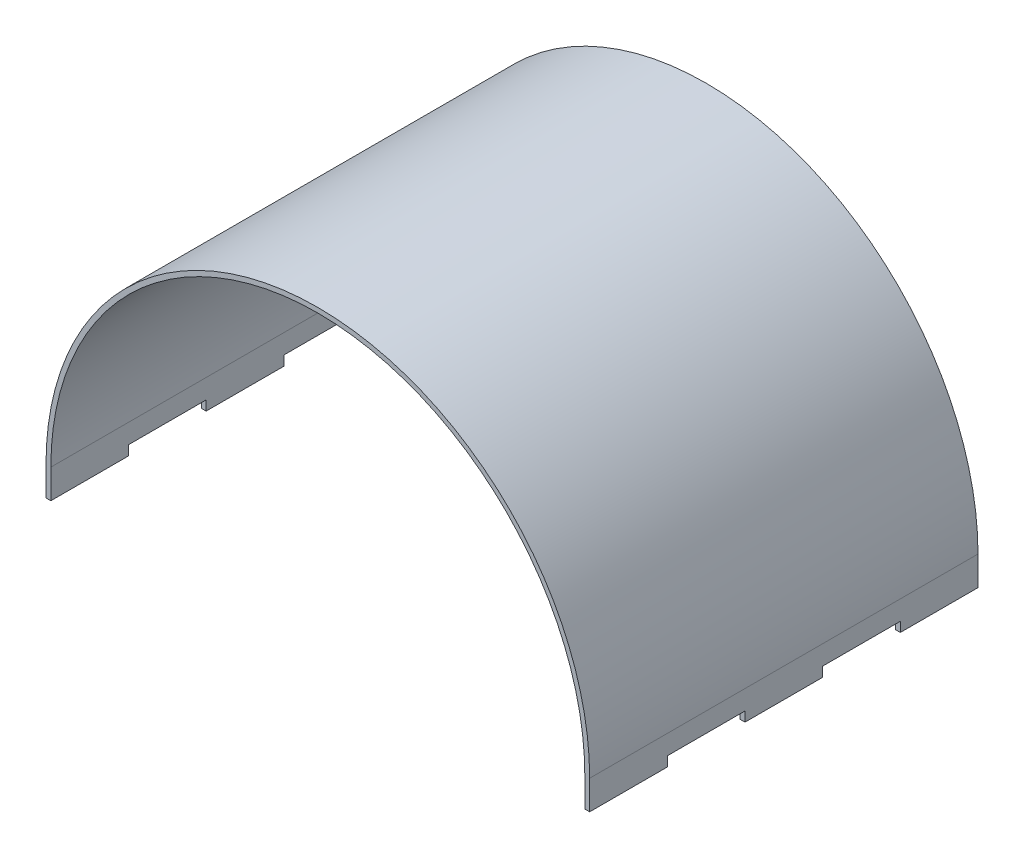
ISO-10303-21;
HEADER;
FILE_DESCRIPTION(('STEP AP214'),'2;1');
FILE_NAME('part.step','',(''),(''),'','','');
FILE_SCHEMA(('AUTOMOTIVE_DESIGN { 1 0 10303 214 1 1 1 1 }'));
ENDSEC;
DATA;
#1=APPLICATION_CONTEXT('core data for automotive mechanical design processes');
#2=APPLICATION_PROTOCOL_DEFINITION('international standard','automotive_design',2000,#1);
#3=PRODUCT_CONTEXT('',#1,'mechanical');
#4=PRODUCT('Part','Part','',(#3));
#5=PRODUCT_RELATED_PRODUCT_CATEGORY('part','',(#4));
#6=PRODUCT_DEFINITION_FORMATION('','',#4);
#7=PRODUCT_DEFINITION_CONTEXT('part definition',#1,'design');
#8=PRODUCT_DEFINITION('design','',#6,#7);
#9=PRODUCT_DEFINITION_SHAPE('','',#8);
#10=(LENGTH_UNIT() NAMED_UNIT(*) SI_UNIT(.MILLI.,.METRE.));
#11=(NAMED_UNIT(*) PLANE_ANGLE_UNIT() SI_UNIT($,.RADIAN.));
#12=(NAMED_UNIT(*) SI_UNIT($,.STERADIAN.) SOLID_ANGLE_UNIT());
#13=UNCERTAINTY_MEASURE_WITH_UNIT(LENGTH_MEASURE(1.E-05),#10,'distance_accuracy_value','');
#14=(GEOMETRIC_REPRESENTATION_CONTEXT(3) GLOBAL_UNCERTAINTY_ASSIGNED_CONTEXT((#13)) GLOBAL_UNIT_ASSIGNED_CONTEXT((#10,
#11,#12)) REPRESENTATION_CONTEXT('',''));
#15=CARTESIAN_POINT('',(0.,0.,0.));
#16=DIRECTION('',(0.,0.,1.));
#17=DIRECTION('',(1.,0.,0.));
#18=AXIS2_PLACEMENT_3D('',#15,#16,#17);
#19=CARTESIAN_POINT('',(0.,0.,254.));
#20=DIRECTION('',(0.,1.,0.));
#21=DIRECTION('',(0.,0.,1.));
#22=AXIS2_PLACEMENT_3D('',#19,#20,#21);
#23=PLANE('',#22);
#24=DIRECTION('',(1.,0.,0.));
#25=VECTOR('',#24,1.);
#26=CARTESIAN_POINT('',(0.,0.,203.2));
#27=LINE('',#26,#25);
#28=CARTESIAN_POINT('',(0.,0.,203.2));
#29=VERTEX_POINT('',#28);
#30=CARTESIAN_POINT('',(3.175,0.,203.2));
#31=VERTEX_POINT('',#30);
#32=EDGE_CURVE('E235',#29,#31,#27,.T.);
#33=ORIENTED_EDGE('',*,*,#32,.T.);
#34=DIRECTION('',(0.,0.,-1.));
#35=VECTOR('',#34,1.);
#36=CARTESIAN_POINT('',(3.175,0.,254.));
#37=LINE('',#36,#35);
#38=CARTESIAN_POINT('',(3.175,0.,254.));
#39=VERTEX_POINT('',#38);
#40=EDGE_CURVE('E353',#39,#31,#37,.T.);
#41=ORIENTED_EDGE('',*,*,#40,.F.);
#42=DIRECTION('',(1.,0.,0.));
#43=VECTOR('',#42,1.);
#44=CARTESIAN_POINT('',(0.,0.,254.));
#45=LINE('',#44,#43);
#46=CARTESIAN_POINT('',(0.,0.,254.));
#47=VERTEX_POINT('',#46);
#48=EDGE_CURVE('E298',#47,#39,#45,.T.);
#49=ORIENTED_EDGE('',*,*,#48,.F.);
#50=DIRECTION('',(0.,0.,-1.));
#51=VECTOR('',#50,1.);
#52=CARTESIAN_POINT('',(0.,0.,254.));
#53=LINE('',#52,#51);
#54=EDGE_CURVE('E11',#47,#29,#53,.T.);
#55=ORIENTED_EDGE('',*,*,#54,.T.);
#56=EDGE_LOOP('',(#33,#41,#49,#55));
#57=FACE_BOUND('',#56,.T.);
#58=ADVANCED_FACE('F35',(#57),#23,.F.);
#59=CARTESIAN_POINT('',(3.175,0.,152.4));
#60=VERTEX_POINT('',#59);
#61=CARTESIAN_POINT('',(3.175,0.,101.6));
#62=VERTEX_POINT('',#61);
#63=EDGE_CURVE('E355',#60,#62,#37,.T.);
#64=ORIENTED_EDGE('',*,*,#63,.F.);
#65=DIRECTION('',(1.,0.,0.));
#66=VECTOR('',#65,1.);
#67=CARTESIAN_POINT('',(0.,0.,152.4));
#68=LINE('',#67,#66);
#69=CARTESIAN_POINT('',(0.,0.,152.4));
#70=VERTEX_POINT('',#69);
#71=EDGE_CURVE('E239',#70,#60,#68,.T.);
#72=ORIENTED_EDGE('',*,*,#71,.F.);
#73=CARTESIAN_POINT('',(0.,0.,101.6));
#74=VERTEX_POINT('',#73);
#75=EDGE_CURVE('E43',#70,#74,#53,.T.);
#76=ORIENTED_EDGE('',*,*,#75,.T.);
#77=DIRECTION('',(1.,0.,0.));
#78=VECTOR('',#77,1.);
#79=CARTESIAN_POINT('',(0.,0.,101.6));
#80=LINE('',#79,#78);
#81=EDGE_CURVE('E249',#74,#62,#80,.T.);
#82=ORIENTED_EDGE('',*,*,#81,.T.);
#83=EDGE_LOOP('',(#64,#72,#76,#82));
#84=FACE_BOUND('',#83,.T.);
#85=ADVANCED_FACE('F452',(#84),#23,.F.);
#86=CARTESIAN_POINT('',(352.425,0.,254.));
#87=DIRECTION('',(0.,1.,0.));
#88=DIRECTION('',(0.,0.,1.));
#89=AXIS2_PLACEMENT_3D('',#86,#87,#88);
#90=PLANE('',#89);
#91=CARTESIAN_POINT('',(352.425,0.,203.2));
#92=VERTEX_POINT('',#91);
#93=CARTESIAN_POINT('',(355.6,0.,203.2));
#94=VERTEX_POINT('',#93);
#95=EDGE_CURVE('E234',#92,#94,#27,.T.);
#96=ORIENTED_EDGE('',*,*,#95,.T.);
#97=DIRECTION('',(0.,0.,-1.));
#98=VECTOR('',#97,1.);
#99=CARTESIAN_POINT('',(355.6,0.,254.));
#100=LINE('',#99,#98);
#101=CARTESIAN_POINT('',(355.6,0.,254.));
#102=VERTEX_POINT('',#101);
#103=EDGE_CURVE('E338',#102,#94,#100,.T.);
#104=ORIENTED_EDGE('',*,*,#103,.F.);
#105=DIRECTION('',(1.,0.,0.));
#106=VECTOR('',#105,1.);
#107=CARTESIAN_POINT('',(352.425,0.,254.));
#108=LINE('',#107,#106);
#109=CARTESIAN_POINT('',(352.425,0.,254.));
#110=VERTEX_POINT('',#109);
#111=EDGE_CURVE('E307',#110,#102,#108,.T.);
#112=ORIENTED_EDGE('',*,*,#111,.F.);
#113=DIRECTION('',(0.,0.,-1.));
#114=VECTOR('',#113,1.);
#115=CARTESIAN_POINT('',(352.425,0.,254.));
#116=LINE('',#115,#114);
#117=EDGE_CURVE('E343',#110,#92,#116,.T.);
#118=ORIENTED_EDGE('',*,*,#117,.T.);
#119=EDGE_LOOP('',(#96,#104,#112,#118));
#120=FACE_BOUND('',#119,.T.);
#121=ADVANCED_FACE('F439',(#120),#90,.F.);
#122=CARTESIAN_POINT('',(355.6,0.,152.4));
#123=VERTEX_POINT('',#122);
#124=CARTESIAN_POINT('',(355.6,0.,101.6));
#125=VERTEX_POINT('',#124);
#126=EDGE_CURVE('E342',#123,#125,#100,.T.);
#127=ORIENTED_EDGE('',*,*,#126,.F.);
#128=CARTESIAN_POINT('',(352.425,0.,152.4));
#129=VERTEX_POINT('',#128);
#130=EDGE_CURVE('E238',#129,#123,#68,.T.);
#131=ORIENTED_EDGE('',*,*,#130,.F.);
#132=CARTESIAN_POINT('',(352.425,0.,101.6));
#133=VERTEX_POINT('',#132);
#134=EDGE_CURVE('E347',#129,#133,#116,.T.);
#135=ORIENTED_EDGE('',*,*,#134,.T.);
#136=EDGE_CURVE('E248',#133,#125,#80,.T.);
#137=ORIENTED_EDGE('',*,*,#136,.T.);
#138=EDGE_LOOP('',(#127,#131,#135,#137));
#139=FACE_BOUND('',#138,.T.);
#140=ADVANCED_FACE('F416',(#139),#90,.F.);
#141=CARTESIAN_POINT('',(0.,0.,254.));
#142=DIRECTION('',(1.,0.,0.));
#143=DIRECTION('',(0.,0.,-1.));
#144=AXIS2_PLACEMENT_3D('',#141,#142,#143);
#145=PLANE('',#144);
#146=ORIENTED_EDGE('',*,*,#75,.F.);
#147=DIRECTION('',(0.,1.,0.));
#148=VECTOR('',#147,1.);
#149=CARTESIAN_POINT('',(0.,0.,152.4));
#150=LINE('',#149,#148);
#151=CARTESIAN_POINT('',(0.,6.35,152.4));
#152=VERTEX_POINT('',#151);
#153=EDGE_CURVE('E205',#70,#152,#150,.T.);
#154=ORIENTED_EDGE('',*,*,#153,.T.);
#155=DIRECTION('',(0.,0.,-1.));
#156=VECTOR('',#155,1.);
#157=CARTESIAN_POINT('',(0.,6.35,203.2));
#158=LINE('',#157,#156);
#159=CARTESIAN_POINT('',(0.,6.35,203.2));
#160=VERTEX_POINT('',#159);
#161=EDGE_CURVE('E197',#160,#152,#158,.T.);
#162=ORIENTED_EDGE('',*,*,#161,.F.);
#163=DIRECTION('',(0.,1.,0.));
#164=VECTOR('',#163,1.);
#165=CARTESIAN_POINT('',(0.,0.,203.2));
#166=LINE('',#165,#164);
#167=EDGE_CURVE('E219',#29,#160,#166,.T.);
#168=ORIENTED_EDGE('',*,*,#167,.F.);
#169=ORIENTED_EDGE('',*,*,#54,.F.);
#170=DIRECTION('',(0.,-1.,0.));
#171=VECTOR('',#170,1.);
#172=CARTESIAN_POINT('',(0.,0.,254.));
#173=LINE('',#172,#171);
#174=CARTESIAN_POINT('',(0.,19.05,254.));
#175=VERTEX_POINT('',#174);
#176=EDGE_CURVE('E295',#175,#47,#173,.T.);
#177=ORIENTED_EDGE('',*,*,#176,.F.);
#178=DIRECTION('',(0.,0.,-1.));
#179=VECTOR('',#178,1.);
#180=CARTESIAN_POINT('',(0.,19.05,254.));
#181=LINE('',#180,#179);
#182=CARTESIAN_POINT('',(0.,19.05,0.));
#183=VERTEX_POINT('',#182);
#184=EDGE_CURVE('E313',#175,#183,#181,.T.);
#185=ORIENTED_EDGE('',*,*,#184,.T.);
#186=DIRECTION('',(0.,-1.,0.));
#187=VECTOR('',#186,1.);
#188=CARTESIAN_POINT('',(0.,0.,0.));
#189=LINE('',#188,#187);
#190=CARTESIAN_POINT('',(0.,0.,0.));
#191=VERTEX_POINT('',#190);
#192=EDGE_CURVE('E294',#183,#191,#189,.T.);
#193=ORIENTED_EDGE('',*,*,#192,.T.);
#194=CARTESIAN_POINT('',(0.,0.,50.8));
#195=VERTEX_POINT('',#194);
#196=EDGE_CURVE('E44',#195,#191,#53,.T.);
#197=ORIENTED_EDGE('',*,*,#196,.F.);
#198=DIRECTION('',(0.,1.,0.));
#199=VECTOR('',#198,1.);
#200=CARTESIAN_POINT('',(0.,0.,50.8));
#201=LINE('',#200,#199);
#202=CARTESIAN_POINT('',(0.,6.35,50.8));
#203=VERTEX_POINT('',#202);
#204=EDGE_CURVE('E265',#195,#203,#201,.T.);
#205=ORIENTED_EDGE('',*,*,#204,.T.);
#206=DIRECTION('',(0.,0.,-1.));
#207=VECTOR('',#206,1.);
#208=CARTESIAN_POINT('',(0.,6.35,101.6));
#209=LINE('',#208,#207);
#210=CARTESIAN_POINT('',(0.,6.35,101.6));
#211=VERTEX_POINT('',#210);
#212=EDGE_CURVE('E259',#211,#203,#209,.T.);
#213=ORIENTED_EDGE('',*,*,#212,.F.);
#214=DIRECTION('',(0.,1.,0.));
#215=VECTOR('',#214,1.);
#216=CARTESIAN_POINT('',(0.,0.,101.6));
#217=LINE('',#216,#215);
#218=EDGE_CURVE('E254',#74,#211,#217,.T.);
#219=ORIENTED_EDGE('',*,*,#218,.F.);
#220=EDGE_LOOP('',(#146,#154,#162,#168,#169,#177,#185,#193,#197,#205,#213,#219));
#221=FACE_BOUND('',#220,.T.);
#222=ADVANCED_FACE('F37',(#221),#145,.F.);
#223=CARTESIAN_POINT('',(3.175,0.,50.8));
#224=VERTEX_POINT('',#223);
#225=CARTESIAN_POINT('',(3.175,0.,0.));
#226=VERTEX_POINT('',#225);
#227=EDGE_CURVE('E352',#224,#226,#37,.T.);
#228=ORIENTED_EDGE('',*,*,#227,.F.);
#229=DIRECTION('',(1.,0.,0.));
#230=VECTOR('',#229,1.);
#231=CARTESIAN_POINT('',(0.,0.,50.8));
#232=LINE('',#231,#230);
#233=EDGE_CURVE('E246',#195,#224,#232,.T.);
#234=ORIENTED_EDGE('',*,*,#233,.F.);
#235=ORIENTED_EDGE('',*,*,#196,.T.);
#236=DIRECTION('',(1.,0.,0.));
#237=VECTOR('',#236,1.);
#238=CARTESIAN_POINT('',(0.,0.,0.));
#239=LINE('',#238,#237);
#240=EDGE_CURVE('E316',#191,#226,#239,.T.);
#241=ORIENTED_EDGE('',*,*,#240,.T.);
#242=EDGE_LOOP('',(#228,#234,#235,#241));
#243=FACE_BOUND('',#242,.T.);
#244=ADVANCED_FACE('F369',(#243),#23,.F.);
#245=CARTESIAN_POINT('',(3.175,0.,254.));
#246=DIRECTION('',(-1.,0.,0.));
#247=DIRECTION('',(0.,0.,1.));
#248=AXIS2_PLACEMENT_3D('',#245,#246,#247);
#249=PLANE('',#248);
#250=DIRECTION('',(0.,0.,1.));
#251=VECTOR('',#250,1.);
#252=CARTESIAN_POINT('',(3.175,6.35,254.));
#253=LINE('',#252,#251);
#254=CARTESIAN_POINT('',(3.175,6.35,152.4));
#255=VERTEX_POINT('',#254);
#256=CARTESIAN_POINT('',(3.175,6.35,203.2));
#257=VERTEX_POINT('',#256);
#258=EDGE_CURVE('E292',#255,#257,#253,.T.);
#259=ORIENTED_EDGE('',*,*,#258,.F.);
#260=DIRECTION('',(0.,-1.,0.));
#261=VECTOR('',#260,1.);
#262=CARTESIAN_POINT('',(3.175,0.,152.4));
#263=LINE('',#262,#261);
#264=EDGE_CURVE('E212',#255,#60,#263,.T.);
#265=ORIENTED_EDGE('',*,*,#264,.T.);
#266=ORIENTED_EDGE('',*,*,#63,.T.);
#267=DIRECTION('',(0.,-1.,0.));
#268=VECTOR('',#267,1.);
#269=CARTESIAN_POINT('',(3.175,0.,101.6));
#270=LINE('',#269,#268);
#271=CARTESIAN_POINT('',(3.175,6.35,101.6));
#272=VERTEX_POINT('',#271);
#273=EDGE_CURVE('E270',#272,#62,#270,.T.);
#274=ORIENTED_EDGE('',*,*,#273,.F.);
#275=DIRECTION('',(0.,0.,1.));
#276=VECTOR('',#275,1.);
#277=CARTESIAN_POINT('',(3.175,6.35,254.));
#278=LINE('',#277,#276);
#279=CARTESIAN_POINT('',(3.175,6.35,50.8));
#280=VERTEX_POINT('',#279);
#281=EDGE_CURVE('E280',#280,#272,#278,.T.);
#282=ORIENTED_EDGE('',*,*,#281,.F.);
#283=DIRECTION('',(0.,-1.,0.));
#284=VECTOR('',#283,1.);
#285=CARTESIAN_POINT('',(3.175,0.,50.8));
#286=LINE('',#285,#284);
#287=EDGE_CURVE('E275',#280,#224,#286,.T.);
#288=ORIENTED_EDGE('',*,*,#287,.T.);
#289=ORIENTED_EDGE('',*,*,#227,.T.);
#290=DIRECTION('',(0.,1.,0.));
#291=VECTOR('',#290,1.);
#292=CARTESIAN_POINT('',(3.175,0.,0.));
#293=LINE('',#292,#291);
#294=CARTESIAN_POINT('',(3.175,19.05,0.));
#295=VERTEX_POINT('',#294);
#296=EDGE_CURVE('E319',#226,#295,#293,.T.);
#297=ORIENTED_EDGE('',*,*,#296,.T.);
#298=DIRECTION('',(0.,0.,-1.));
#299=VECTOR('',#298,1.);
#300=CARTESIAN_POINT('',(3.175,19.05,254.));
#301=LINE('',#300,#299);
#302=CARTESIAN_POINT('',(3.175,19.05,254.));
#303=VERTEX_POINT('',#302);
#304=EDGE_CURVE('E350',#303,#295,#301,.T.);
#305=ORIENTED_EDGE('',*,*,#304,.F.);
#306=DIRECTION('',(0.,1.,0.));
#307=VECTOR('',#306,1.);
#308=CARTESIAN_POINT('',(3.175,0.,254.));
#309=LINE('',#308,#307);
#310=EDGE_CURVE('E301',#39,#303,#309,.T.);
#311=ORIENTED_EDGE('',*,*,#310,.F.);
#312=ORIENTED_EDGE('',*,*,#40,.T.);
#313=DIRECTION('',(0.,-1.,0.));
#314=VECTOR('',#313,1.);
#315=CARTESIAN_POINT('',(3.175,0.,203.2));
#316=LINE('',#315,#314);
#317=EDGE_CURVE('E284',#257,#31,#316,.T.);
#318=ORIENTED_EDGE('',*,*,#317,.F.);
#319=EDGE_LOOP('',(#259,#265,#266,#274,#282,#288,#289,#297,#305,#311,#312,#318));
#320=FACE_BOUND('',#319,.T.);
#321=ADVANCED_FACE('F362',(#320),#249,.F.);
#322=CARTESIAN_POINT('',(177.8,19.05,254.));
#323=DIRECTION('',(0.,0.,-1.));
#324=DIRECTION('',(-1.,0.,0.));
#325=AXIS2_PLACEMENT_3D('',#322,#323,#324);
#326=CYLINDRICAL_SURFACE('',#325,174.625);
#327=CARTESIAN_POINT('',(177.8,19.05,0.));
#328=DIRECTION('',(0.,0.,-1.));
#329=DIRECTION('',(1.,0.,0.));
#330=AXIS2_PLACEMENT_3D('',#327,#328,#329);
#331=CIRCLE('',#330,174.625);
#332=CARTESIAN_POINT('',(352.425,19.05,0.));
#333=VERTEX_POINT('',#332);
#334=EDGE_CURVE('E321',#295,#333,#331,.T.);
#335=ORIENTED_EDGE('',*,*,#334,.T.);
#336=DIRECTION('',(0.,0.,-1.));
#337=VECTOR('',#336,1.);
#338=CARTESIAN_POINT('',(352.425,19.05,254.));
#339=LINE('',#338,#337);
#340=CARTESIAN_POINT('',(352.425,19.05,254.));
#341=VERTEX_POINT('',#340);
#342=EDGE_CURVE('E346',#341,#333,#339,.T.);
#343=ORIENTED_EDGE('',*,*,#342,.F.);
#344=CARTESIAN_POINT('',(177.8,19.05,254.));
#345=DIRECTION('',(0.,0.,-1.));
#346=DIRECTION('',(1.,0.,0.));
#347=AXIS2_PLACEMENT_3D('',#344,#345,#346);
#348=CIRCLE('',#347,174.625);
#349=EDGE_CURVE('E303',#303,#341,#348,.T.);
#350=ORIENTED_EDGE('',*,*,#349,.F.);
#351=ORIENTED_EDGE('',*,*,#304,.T.);
#352=EDGE_LOOP('',(#335,#343,#350,#351));
#353=FACE_BOUND('',#352,.T.);
#354=ADVANCED_FACE('F379',(#353),#326,.F.);
#355=CARTESIAN_POINT('',(352.425,0.,254.));
#356=DIRECTION('',(1.,0.,0.));
#357=DIRECTION('',(0.,0.,-1.));
#358=AXIS2_PLACEMENT_3D('',#355,#356,#357);
#359=PLANE('',#358);
#360=ORIENTED_EDGE('',*,*,#134,.F.);
#361=DIRECTION('',(0.,1.,0.));
#362=VECTOR('',#361,1.);
#363=CARTESIAN_POINT('',(352.425,0.,152.4));
#364=LINE('',#363,#362);
#365=CARTESIAN_POINT('',(352.425,6.35,152.4));
#366=VERTEX_POINT('',#365);
#367=EDGE_CURVE('E286',#129,#366,#364,.T.);
#368=ORIENTED_EDGE('',*,*,#367,.T.);
#369=DIRECTION('',(0.,0.,-1.));
#370=VECTOR('',#369,1.);
#371=CARTESIAN_POINT('',(352.425,6.35,254.));
#372=LINE('',#371,#370);
#373=CARTESIAN_POINT('',(352.425,6.35,203.2));
#374=VERTEX_POINT('',#373);
#375=EDGE_CURVE('E290',#374,#366,#372,.T.);
#376=ORIENTED_EDGE('',*,*,#375,.F.);
#377=DIRECTION('',(0.,1.,0.));
#378=VECTOR('',#377,1.);
#379=CARTESIAN_POINT('',(352.425,0.,203.2));
#380=LINE('',#379,#378);
#381=EDGE_CURVE('E282',#92,#374,#380,.T.);
#382=ORIENTED_EDGE('',*,*,#381,.F.);
#383=ORIENTED_EDGE('',*,*,#117,.F.);
#384=DIRECTION('',(0.,-1.,0.));
#385=VECTOR('',#384,1.);
#386=CARTESIAN_POINT('',(352.425,0.,254.));
#387=LINE('',#386,#385);
#388=EDGE_CURVE('E305',#341,#110,#387,.T.);
#389=ORIENTED_EDGE('',*,*,#388,.F.);
#390=ORIENTED_EDGE('',*,*,#342,.T.);
#391=DIRECTION('',(0.,-1.,0.));
#392=VECTOR('',#391,1.);
#393=CARTESIAN_POINT('',(352.425,0.,0.));
#394=LINE('',#393,#392);
#395=CARTESIAN_POINT('',(352.425,0.,0.));
#396=VERTEX_POINT('',#395);
#397=EDGE_CURVE('E323',#333,#396,#394,.T.);
#398=ORIENTED_EDGE('',*,*,#397,.T.);
#399=CARTESIAN_POINT('',(352.425,0.,50.8));
#400=VERTEX_POINT('',#399);
#401=EDGE_CURVE('E341',#400,#396,#116,.T.);
#402=ORIENTED_EDGE('',*,*,#401,.F.);
#403=DIRECTION('',(0.,1.,0.));
#404=VECTOR('',#403,1.);
#405=CARTESIAN_POINT('',(352.425,0.,50.8));
#406=LINE('',#405,#404);
#407=CARTESIAN_POINT('',(352.425,6.35,50.8));
#408=VERTEX_POINT('',#407);
#409=EDGE_CURVE('E272',#400,#408,#406,.T.);
#410=ORIENTED_EDGE('',*,*,#409,.T.);
#411=DIRECTION('',(0.,0.,-1.));
#412=VECTOR('',#411,1.);
#413=CARTESIAN_POINT('',(352.425,6.35,254.));
#414=LINE('',#413,#412);
#415=CARTESIAN_POINT('',(352.425,6.35,101.6));
#416=VERTEX_POINT('',#415);
#417=EDGE_CURVE('E278',#416,#408,#414,.T.);
#418=ORIENTED_EDGE('',*,*,#417,.F.);
#419=DIRECTION('',(0.,1.,0.));
#420=VECTOR('',#419,1.);
#421=CARTESIAN_POINT('',(352.425,0.,101.6));
#422=LINE('',#421,#420);
#423=EDGE_CURVE('E213',#133,#416,#422,.T.);
#424=ORIENTED_EDGE('',*,*,#423,.F.);
#425=EDGE_LOOP('',(#360,#368,#376,#382,#383,#389,#390,#398,#402,#410,#418,#424));
#426=FACE_BOUND('',#425,.T.);
#427=ADVANCED_FACE('F384',(#426),#359,.F.);
#428=CARTESIAN_POINT('',(355.6,0.,50.8));
#429=VERTEX_POINT('',#428);
#430=CARTESIAN_POINT('',(355.6,0.,0.));
#431=VERTEX_POINT('',#430);
#432=EDGE_CURVE('E337',#429,#431,#100,.T.);
#433=ORIENTED_EDGE('',*,*,#432,.F.);
#434=EDGE_CURVE('E244',#400,#429,#232,.T.);
#435=ORIENTED_EDGE('',*,*,#434,.F.);
#436=ORIENTED_EDGE('',*,*,#401,.T.);
#437=DIRECTION('',(1.,0.,0.));
#438=VECTOR('',#437,1.);
#439=CARTESIAN_POINT('',(352.425,0.,0.));
#440=LINE('',#439,#438);
#441=EDGE_CURVE('E326',#396,#431,#440,.T.);
#442=ORIENTED_EDGE('',*,*,#441,.T.);
#443=EDGE_LOOP('',(#433,#435,#436,#442));
#444=FACE_BOUND('',#443,.T.);
#445=ADVANCED_FACE('F410',(#444),#90,.F.);
#446=CARTESIAN_POINT('',(355.6,0.,254.));
#447=DIRECTION('',(-1.,0.,0.));
#448=DIRECTION('',(0.,0.,1.));
#449=AXIS2_PLACEMENT_3D('',#446,#447,#448);
#450=PLANE('',#449);
#451=DIRECTION('',(0.,0.,-1.));
#452=VECTOR('',#451,1.);
#453=CARTESIAN_POINT('',(355.6,6.35,203.2));
#454=LINE('',#453,#452);
#455=CARTESIAN_POINT('',(355.6,6.35,203.2));
#456=VERTEX_POINT('',#455);
#457=CARTESIAN_POINT('',(355.6,6.35,152.4));
#458=VERTEX_POINT('',#457);
#459=EDGE_CURVE('E224',#456,#458,#454,.T.);
#460=ORIENTED_EDGE('',*,*,#459,.T.);
#461=DIRECTION('',(0.,1.,0.));
#462=VECTOR('',#461,1.);
#463=CARTESIAN_POINT('',(355.6,0.,152.4));
#464=LINE('',#463,#462);
#465=EDGE_CURVE('E227',#123,#458,#464,.T.);
#466=ORIENTED_EDGE('',*,*,#465,.F.);
#467=ORIENTED_EDGE('',*,*,#126,.T.);
#468=DIRECTION('',(0.,1.,0.));
#469=VECTOR('',#468,1.);
#470=CARTESIAN_POINT('',(355.6,0.,101.6));
#471=LINE('',#470,#469);
#472=CARTESIAN_POINT('',(355.6,6.35,101.6));
#473=VERTEX_POINT('',#472);
#474=EDGE_CURVE('E255',#125,#473,#471,.T.);
#475=ORIENTED_EDGE('',*,*,#474,.T.);
#476=DIRECTION('',(0.,0.,-1.));
#477=VECTOR('',#476,1.);
#478=CARTESIAN_POINT('',(355.6,6.35,101.6));
#479=LINE('',#478,#477);
#480=CARTESIAN_POINT('',(355.6,6.35,50.8));
#481=VERTEX_POINT('',#480);
#482=EDGE_CURVE('E228',#473,#481,#479,.T.);
#483=ORIENTED_EDGE('',*,*,#482,.T.);
#484=DIRECTION('',(0.,1.,0.));
#485=VECTOR('',#484,1.);
#486=CARTESIAN_POINT('',(355.6,0.,50.8));
#487=LINE('',#486,#485);
#488=EDGE_CURVE('E258',#429,#481,#487,.T.);
#489=ORIENTED_EDGE('',*,*,#488,.F.);
#490=ORIENTED_EDGE('',*,*,#432,.T.);
#491=DIRECTION('',(0.,1.,0.));
#492=VECTOR('',#491,1.);
#493=CARTESIAN_POINT('',(355.6,0.,0.));
#494=LINE('',#493,#492);
#495=CARTESIAN_POINT('',(355.6,19.05,0.));
#496=VERTEX_POINT('',#495);
#497=EDGE_CURVE('E329',#431,#496,#494,.T.);
#498=ORIENTED_EDGE('',*,*,#497,.T.);
#499=DIRECTION('',(0.,0.,-1.));
#500=VECTOR('',#499,1.);
#501=CARTESIAN_POINT('',(355.6,19.05,254.));
#502=LINE('',#501,#500);
#503=CARTESIAN_POINT('',(355.6,19.05,254.));
#504=VERTEX_POINT('',#503);
#505=EDGE_CURVE('E334',#504,#496,#502,.T.);
#506=ORIENTED_EDGE('',*,*,#505,.F.);
#507=DIRECTION('',(0.,1.,0.));
#508=VECTOR('',#507,1.);
#509=CARTESIAN_POINT('',(355.6,0.,254.));
#510=LINE('',#509,#508);
#511=EDGE_CURVE('E309',#102,#504,#510,.T.);
#512=ORIENTED_EDGE('',*,*,#511,.F.);
#513=ORIENTED_EDGE('',*,*,#103,.T.);
#514=DIRECTION('',(0.,1.,0.));
#515=VECTOR('',#514,1.);
#516=CARTESIAN_POINT('',(355.6,0.,203.2));
#517=LINE('',#516,#515);
#518=EDGE_CURVE('E206',#94,#456,#517,.T.);
#519=ORIENTED_EDGE('',*,*,#518,.T.);
#520=EDGE_LOOP('',(#460,#466,#467,#475,#483,#489,#490,#498,#506,#512,#513,#519));
#521=FACE_BOUND('',#520,.T.);
#522=ADVANCED_FACE('F405',(#521),#450,.F.);
#523=CARTESIAN_POINT('',(177.8,19.05,254.));
#524=DIRECTION('',(0.,0.,-1.));
#525=DIRECTION('',(-1.,0.,0.));
#526=AXIS2_PLACEMENT_3D('',#523,#524,#525);
#527=CYLINDRICAL_SURFACE('',#526,177.8);
#528=CARTESIAN_POINT('',(177.8,19.05,0.));
#529=DIRECTION('',(0.,0.,1.));
#530=DIRECTION('',(-1.,0.,0.));
#531=AXIS2_PLACEMENT_3D('',#528,#529,#530);
#532=CIRCLE('',#531,177.8);
#533=EDGE_CURVE('E299',#496,#183,#532,.T.);
#534=ORIENTED_EDGE('',*,*,#533,.T.);
#535=ORIENTED_EDGE('',*,*,#184,.F.);
#536=CARTESIAN_POINT('',(177.8,19.05,254.));
#537=DIRECTION('',(0.,0.,1.));
#538=DIRECTION('',(-1.,0.,0.));
#539=AXIS2_PLACEMENT_3D('',#536,#537,#538);
#540=CIRCLE('',#539,177.8);
#541=EDGE_CURVE('E311',#504,#175,#540,.T.);
#542=ORIENTED_EDGE('',*,*,#541,.F.);
#543=ORIENTED_EDGE('',*,*,#505,.T.);
#544=EDGE_LOOP('',(#534,#535,#542,#543));
#545=FACE_BOUND('',#544,.T.);
#546=ADVANCED_FACE('F401',(#545),#527,.T.);
#547=CARTESIAN_POINT('',(177.8,19.05,254.));
#548=DIRECTION('',(0.,0.,-1.));
#549=DIRECTION('',(-1.,0.,0.));
#550=AXIS2_PLACEMENT_3D('',#547,#548,#549);
#551=PLANE('',#550);
#552=ORIENTED_EDGE('',*,*,#176,.T.);
#553=ORIENTED_EDGE('',*,*,#48,.T.);
#554=ORIENTED_EDGE('',*,*,#310,.T.);
#555=ORIENTED_EDGE('',*,*,#349,.T.);
#556=ORIENTED_EDGE('',*,*,#388,.T.);
#557=ORIENTED_EDGE('',*,*,#111,.T.);
#558=ORIENTED_EDGE('',*,*,#511,.T.);
#559=ORIENTED_EDGE('',*,*,#541,.T.);
#560=EDGE_LOOP('',(#552,#553,#554,#555,#556,#557,#558,#559));
#561=FACE_BOUND('',#560,.T.);
#562=ADVANCED_FACE('F390',(#561),#551,.F.);
#563=CARTESIAN_POINT('',(177.8,19.05,0.));
#564=DIRECTION('',(0.,0.,-1.));
#565=DIRECTION('',(-1.,0.,0.));
#566=AXIS2_PLACEMENT_3D('',#563,#564,#565);
#567=PLANE('',#566);
#568=ORIENTED_EDGE('',*,*,#192,.F.);
#569=ORIENTED_EDGE('',*,*,#533,.F.);
#570=ORIENTED_EDGE('',*,*,#497,.F.);
#571=ORIENTED_EDGE('',*,*,#441,.F.);
#572=ORIENTED_EDGE('',*,*,#397,.F.);
#573=ORIENTED_EDGE('',*,*,#334,.F.);
#574=ORIENTED_EDGE('',*,*,#296,.F.);
#575=ORIENTED_EDGE('',*,*,#240,.F.);
#576=EDGE_LOOP('',(#568,#569,#570,#571,#572,#573,#574,#575));
#577=FACE_BOUND('',#576,.T.);
#578=ADVANCED_FACE('F374',(#577),#567,.T.);
#579=CARTESIAN_POINT('',(0.,0.,50.8));
#580=DIRECTION('',(0.,0.,-1.));
#581=DIRECTION('',(-1.,0.,0.));
#582=AXIS2_PLACEMENT_3D('',#579,#580,#581);
#583=PLANE('',#582);
#584=ORIENTED_EDGE('',*,*,#434,.T.);
#585=ORIENTED_EDGE('',*,*,#488,.T.);
#586=DIRECTION('',(1.,0.,0.));
#587=VECTOR('',#586,1.);
#588=CARTESIAN_POINT('',(0.,6.35,50.8));
#589=LINE('',#588,#587);
#590=EDGE_CURVE('E245',#408,#481,#589,.T.);
#591=ORIENTED_EDGE('',*,*,#590,.F.);
#592=ORIENTED_EDGE('',*,*,#409,.F.);
#593=EDGE_LOOP('',(#584,#585,#591,#592));
#594=FACE_BOUND('',#593,.T.);
#595=ADVANCED_FACE('F511',(#594),#583,.F.);
#596=CARTESIAN_POINT('',(0.,0.,101.6));
#597=DIRECTION('',(0.,0.,-1.));
#598=DIRECTION('',(-1.,0.,0.));
#599=AXIS2_PLACEMENT_3D('',#596,#597,#598);
#600=PLANE('',#599);
#601=ORIENTED_EDGE('',*,*,#423,.T.);
#602=DIRECTION('',(1.,0.,0.));
#603=VECTOR('',#602,1.);
#604=CARTESIAN_POINT('',(0.,6.35,101.6));
#605=LINE('',#604,#603);
#606=EDGE_CURVE('E252',#416,#473,#605,.T.);
#607=ORIENTED_EDGE('',*,*,#606,.T.);
#608=ORIENTED_EDGE('',*,*,#474,.F.);
#609=ORIENTED_EDGE('',*,*,#136,.F.);
#610=EDGE_LOOP('',(#601,#607,#608,#609));
#611=FACE_BOUND('',#610,.T.);
#612=ADVANCED_FACE('F424',(#611),#600,.T.);
#613=CARTESIAN_POINT('',(0.,6.35,101.6));
#614=DIRECTION('',(0.,-1.,0.));
#615=DIRECTION('',(0.,0.,-1.));
#616=AXIS2_PLACEMENT_3D('',#613,#614,#615);
#617=PLANE('',#616);
#618=ORIENTED_EDGE('',*,*,#417,.T.);
#619=ORIENTED_EDGE('',*,*,#590,.T.);
#620=ORIENTED_EDGE('',*,*,#482,.F.);
#621=ORIENTED_EDGE('',*,*,#606,.F.);
#622=EDGE_LOOP('',(#618,#619,#620,#621));
#623=FACE_BOUND('',#622,.T.);
#624=ADVANCED_FACE('F426',(#623),#617,.T.);
#625=CARTESIAN_POINT('',(0.,0.,152.4));
#626=DIRECTION('',(0.,0.,-1.));
#627=DIRECTION('',(-1.,0.,0.));
#628=AXIS2_PLACEMENT_3D('',#625,#626,#627);
#629=PLANE('',#628);
#630=ORIENTED_EDGE('',*,*,#130,.T.);
#631=ORIENTED_EDGE('',*,*,#465,.T.);
#632=DIRECTION('',(1.,0.,0.));
#633=VECTOR('',#632,1.);
#634=CARTESIAN_POINT('',(0.,6.35,152.4));
#635=LINE('',#634,#633);
#636=EDGE_CURVE('E214',#366,#458,#635,.T.);
#637=ORIENTED_EDGE('',*,*,#636,.F.);
#638=ORIENTED_EDGE('',*,*,#367,.F.);
#639=EDGE_LOOP('',(#630,#631,#637,#638));
#640=FACE_BOUND('',#639,.T.);
#641=ADVANCED_FACE('F431',(#640),#629,.F.);
#642=CARTESIAN_POINT('',(0.,0.,203.2));
#643=DIRECTION('',(0.,0.,-1.));
#644=DIRECTION('',(-1.,0.,0.));
#645=AXIS2_PLACEMENT_3D('',#642,#643,#644);
#646=PLANE('',#645);
#647=ORIENTED_EDGE('',*,*,#381,.T.);
#648=DIRECTION('',(1.,0.,0.));
#649=VECTOR('',#648,1.);
#650=CARTESIAN_POINT('',(0.,6.35,203.2));
#651=LINE('',#650,#649);
#652=EDGE_CURVE('E221',#374,#456,#651,.T.);
#653=ORIENTED_EDGE('',*,*,#652,.T.);
#654=ORIENTED_EDGE('',*,*,#518,.F.);
#655=ORIENTED_EDGE('',*,*,#95,.F.);
#656=EDGE_LOOP('',(#647,#653,#654,#655));
#657=FACE_BOUND('',#656,.T.);
#658=ADVANCED_FACE('F440',(#657),#646,.T.);
#659=CARTESIAN_POINT('',(0.,6.35,203.2));
#660=DIRECTION('',(0.,-1.,0.));
#661=DIRECTION('',(0.,0.,-1.));
#662=AXIS2_PLACEMENT_3D('',#659,#660,#661);
#663=PLANE('',#662);
#664=ORIENTED_EDGE('',*,*,#375,.T.);
#665=ORIENTED_EDGE('',*,*,#636,.T.);
#666=ORIENTED_EDGE('',*,*,#459,.F.);
#667=ORIENTED_EDGE('',*,*,#652,.F.);
#668=EDGE_LOOP('',(#664,#665,#666,#667));
#669=FACE_BOUND('',#668,.T.);
#670=ADVANCED_FACE('F433',(#669),#663,.T.);
#671=ORIENTED_EDGE('',*,*,#281,.T.);
#672=EDGE_CURVE('E59',#211,#272,#605,.T.);
#673=ORIENTED_EDGE('',*,*,#672,.F.);
#674=ORIENTED_EDGE('',*,*,#212,.T.);
#675=EDGE_CURVE('E241',#203,#280,#589,.T.);
#676=ORIENTED_EDGE('',*,*,#675,.T.);
#677=EDGE_LOOP('',(#671,#673,#674,#676));
#678=FACE_BOUND('',#677,.T.);
#679=ADVANCED_FACE('F447',(#678),#617,.T.);
#680=ORIENTED_EDGE('',*,*,#675,.F.);
#681=ORIENTED_EDGE('',*,*,#204,.F.);
#682=ORIENTED_EDGE('',*,*,#233,.T.);
#683=ORIENTED_EDGE('',*,*,#287,.F.);
#684=EDGE_LOOP('',(#680,#681,#682,#683));
#685=FACE_BOUND('',#684,.T.);
#686=ADVANCED_FACE('F518',(#685),#583,.F.);
#687=ORIENTED_EDGE('',*,*,#273,.T.);
#688=ORIENTED_EDGE('',*,*,#81,.F.);
#689=ORIENTED_EDGE('',*,*,#218,.T.);
#690=ORIENTED_EDGE('',*,*,#672,.T.);
#691=EDGE_LOOP('',(#687,#688,#689,#690));
#692=FACE_BOUND('',#691,.T.);
#693=ADVANCED_FACE('F529',(#692),#600,.T.);
#694=ORIENTED_EDGE('',*,*,#258,.T.);
#695=EDGE_CURVE('E51',#160,#257,#651,.T.);
#696=ORIENTED_EDGE('',*,*,#695,.F.);
#697=ORIENTED_EDGE('',*,*,#161,.T.);
#698=EDGE_CURVE('E200',#152,#255,#635,.T.);
#699=ORIENTED_EDGE('',*,*,#698,.T.);
#700=EDGE_LOOP('',(#694,#696,#697,#699));
#701=FACE_BOUND('',#700,.T.);
#702=ADVANCED_FACE('F199',(#701),#663,.T.);
#703=ORIENTED_EDGE('',*,*,#698,.F.);
#704=ORIENTED_EDGE('',*,*,#153,.F.);
#705=ORIENTED_EDGE('',*,*,#71,.T.);
#706=ORIENTED_EDGE('',*,*,#264,.F.);
#707=EDGE_LOOP('',(#703,#704,#705,#706));
#708=FACE_BOUND('',#707,.T.);
#709=ADVANCED_FACE('F209',(#708),#629,.F.);
#710=ORIENTED_EDGE('',*,*,#317,.T.);
#711=ORIENTED_EDGE('',*,*,#32,.F.);
#712=ORIENTED_EDGE('',*,*,#167,.T.);
#713=ORIENTED_EDGE('',*,*,#695,.T.);
#714=EDGE_LOOP('',(#710,#711,#712,#713));
#715=FACE_BOUND('',#714,.T.);
#716=ADVANCED_FACE('F395',(#715),#646,.T.);
#717=CLOSED_SHELL('',(#58,#85,#121,#140,#222,#244,#321,#354,#427,#445,#522,#546,#562,#578,#595,
#612,#624,#641,#658,#670,#679,#686,#693,#702,#709,#716));
#718=MANIFOLD_SOLID_BREP('B2',#717);
#719=ADVANCED_BREP_SHAPE_REPRESENTATION('',(#18,#718),#14);
#720=SHAPE_DEFINITION_REPRESENTATION(#9,#719);
ENDSEC;
END-ISO-10303-21;
